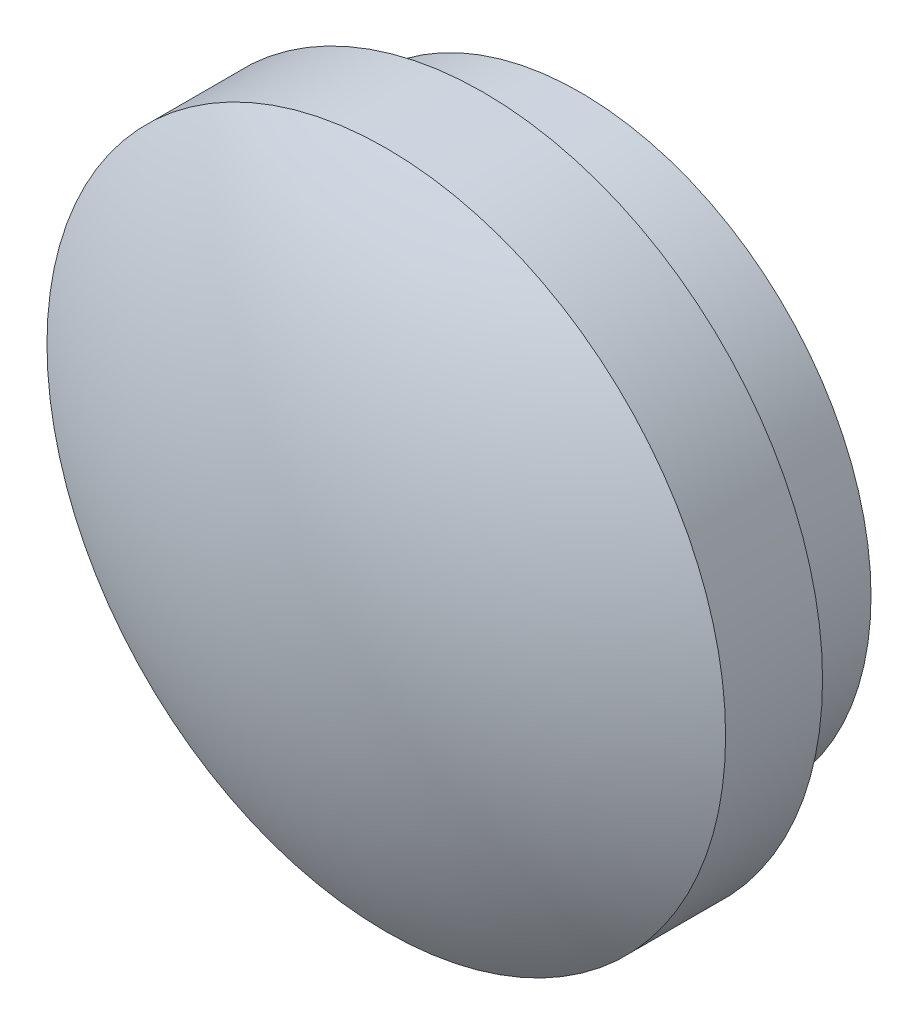
ISO-10303-21;
HEADER;
FILE_DESCRIPTION(('STEP AP214'),'2;1');
FILE_NAME('part.step','',(''),(''),'','','');
FILE_SCHEMA(('AUTOMOTIVE_DESIGN { 1 0 10303 214 1 1 1 1 }'));
ENDSEC;
DATA;
#1=APPLICATION_CONTEXT('core data for automotive mechanical design processes');
#2=APPLICATION_PROTOCOL_DEFINITION('international standard','automotive_design',2000,#1);
#3=PRODUCT_CONTEXT('',#1,'mechanical');
#4=PRODUCT('Part','Part','',(#3));
#5=PRODUCT_RELATED_PRODUCT_CATEGORY('part','',(#4));
#6=PRODUCT_DEFINITION_FORMATION('','',#4);
#7=PRODUCT_DEFINITION_CONTEXT('part definition',#1,'design');
#8=PRODUCT_DEFINITION('design','',#6,#7);
#9=PRODUCT_DEFINITION_SHAPE('','',#8);
#10=(LENGTH_UNIT() NAMED_UNIT(*) SI_UNIT(.MILLI.,.METRE.));
#11=(NAMED_UNIT(*) PLANE_ANGLE_UNIT() SI_UNIT($,.RADIAN.));
#12=(NAMED_UNIT(*) SI_UNIT($,.STERADIAN.) SOLID_ANGLE_UNIT());
#13=UNCERTAINTY_MEASURE_WITH_UNIT(LENGTH_MEASURE(1.E-05),#10,'distance_accuracy_value','');
#14=(GEOMETRIC_REPRESENTATION_CONTEXT(3) GLOBAL_UNCERTAINTY_ASSIGNED_CONTEXT((#13)) GLOBAL_UNIT_ASSIGNED_CONTEXT((#10,
#11,#12)) REPRESENTATION_CONTEXT('',''));
#15=CARTESIAN_POINT('',(0.,0.,0.));
#16=DIRECTION('',(0.,0.,1.));
#17=DIRECTION('',(1.,0.,0.));
#18=AXIS2_PLACEMENT_3D('',#15,#16,#17);
#19=CARTESIAN_POINT('',(0.,0.,2.54));
#20=DIRECTION('',(0.,0.,-1.));
#21=DIRECTION('',(-1.,0.,0.));
#22=AXIS2_PLACEMENT_3D('',#19,#20,#21);
#23=CYLINDRICAL_SURFACE('',#22,7.62);
#24=CARTESIAN_POINT('',(0.,0.,2.54));
#25=DIRECTION('',(0.,0.,1.));
#26=DIRECTION('',(1.,0.,0.));
#27=AXIS2_PLACEMENT_3D('',#24,#25,#26);
#28=CIRCLE('',#27,7.62);
#29=CARTESIAN_POINT('',(7.62,0.,2.54));
#30=VERTEX_POINT('',#29);
#31=EDGE_CURVE('E10',#30,#30,#28,.T.);
#32=ORIENTED_EDGE('',*,*,#31,.F.);
#33=EDGE_LOOP('',(#32));
#34=FACE_BOUND('',#33,.T.);
#35=CARTESIAN_POINT('',(0.,0.,0.));
#36=DIRECTION('',(0.,0.,1.));
#37=DIRECTION('',(1.,0.,0.));
#38=AXIS2_PLACEMENT_3D('',#35,#36,#37);
#39=CIRCLE('',#38,7.62);
#40=CARTESIAN_POINT('',(7.62,0.,0.));
#41=VERTEX_POINT('',#40);
#42=EDGE_CURVE('E37',#41,#41,#39,.T.);
#43=ORIENTED_EDGE('',*,*,#42,.T.);
#44=EDGE_LOOP('',(#43));
#45=FACE_BOUND('',#44,.T.);
#46=ADVANCED_FACE('F29',(#34,#45),#23,.T.);
#47=CARTESIAN_POINT('',(0.,0.,0.));
#48=DIRECTION('',(0.,0.,1.));
#49=DIRECTION('',(1.,0.,0.));
#50=AXIS2_PLACEMENT_3D('',#47,#48,#49);
#51=PLANE('',#50);
#52=ORIENTED_EDGE('',*,*,#42,.F.);
#53=EDGE_LOOP('',(#52));
#54=FACE_BOUND('',#53,.T.);
#55=ADVANCED_FACE('F59',(#54),#51,.F.);
#56=CARTESIAN_POINT('',(0.,0.,2.54));
#57=DIRECTION('',(0.,0.,1.));
#58=DIRECTION('',(1.,0.,0.));
#59=AXIS2_PLACEMENT_3D('',#56,#57,#58);
#60=PLANE('',#59);
#61=CARTESIAN_POINT('',(0.,0.,2.54));
#62=DIRECTION('',(0.,0.,1.));
#63=DIRECTION('',(1.,0.,0.));
#64=AXIS2_PLACEMENT_3D('',#61,#62,#63);
#65=CIRCLE('',#64,8.89);
#66=CARTESIAN_POINT('',(8.89,0.,2.54));
#67=VERTEX_POINT('',#66);
#68=EDGE_CURVE('E43',#67,#67,#65,.T.);
#69=ORIENTED_EDGE('',*,*,#68,.F.);
#70=EDGE_LOOP('',(#69));
#71=FACE_BOUND('',#70,.T.);
#72=ORIENTED_EDGE('',*,*,#31,.T.);
#73=EDGE_LOOP('',(#72));
#74=FACE_BOUND('',#73,.T.);
#75=ADVANCED_FACE('F53',(#71,#74),#60,.F.);
#76=CARTESIAN_POINT('',(0.,0.,5.08));
#77=DIRECTION('',(0.,0.,-1.));
#78=DIRECTION('',(-1.,0.,0.));
#79=AXIS2_PLACEMENT_3D('',#76,#77,#78);
#80=CYLINDRICAL_SURFACE('',#79,8.89);
#81=CARTESIAN_POINT('',(0.,0.,5.08));
#82=DIRECTION('',(0.,0.,1.));
#83=DIRECTION('',(1.,0.,0.));
#84=AXIS2_PLACEMENT_3D('',#81,#82,#83);
#85=CIRCLE('',#84,8.89);
#86=CARTESIAN_POINT('',(8.89,0.,5.08));
#87=VERTEX_POINT('',#86);
#88=EDGE_CURVE('E33',#87,#87,#85,.T.);
#89=ORIENTED_EDGE('',*,*,#88,.F.);
#90=EDGE_LOOP('',(#89));
#91=FACE_BOUND('',#90,.T.);
#92=ORIENTED_EDGE('',*,*,#68,.T.);
#93=EDGE_LOOP('',(#92));
#94=FACE_BOUND('',#93,.T.);
#95=ADVANCED_FACE('F51',(#91,#94),#80,.T.);
#96=CARTESIAN_POINT('',(0.,0.,-9.2075));
#97=DIRECTION('',(0.,0.,1.));
#98=DIRECTION('',(1.,0.,0.));
#99=AXIS2_PLACEMENT_3D('',#96,#97,#98);
#100=SPHERICAL_SURFACE('',#99,16.8275);
#101=ORIENTED_EDGE('',*,*,#88,.T.);
#102=EDGE_LOOP('',(#101));
#103=FACE_BOUND('',#102,.T.);
#104=ADVANCED_FACE('F31',(#103),#100,.T.);
#105=CLOSED_SHELL('',(#46,#55,#75,#95,#104));
#106=MANIFOLD_SOLID_BREP('B2',#105);
#107=ADVANCED_BREP_SHAPE_REPRESENTATION('',(#18,#106),#14);
#108=SHAPE_DEFINITION_REPRESENTATION(#9,#107);
ENDSEC;
END-ISO-10303-21;
